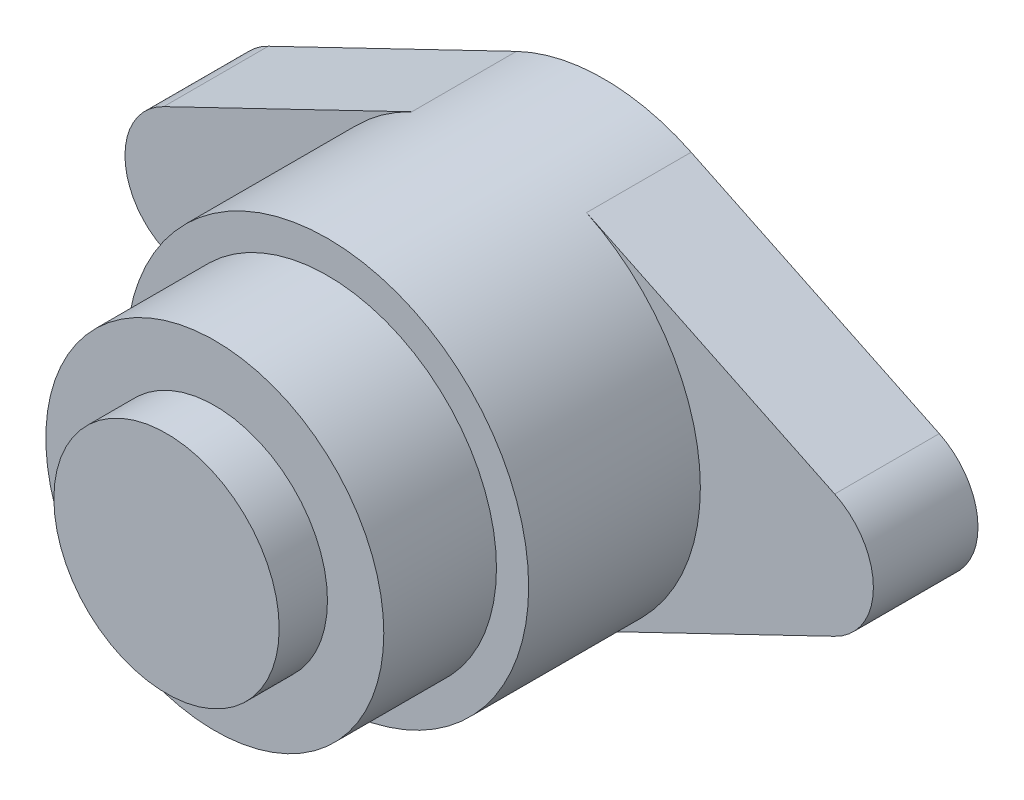
ISO-10303-21;
HEADER;
FILE_DESCRIPTION(('STEP AP214'),'2;1');
FILE_NAME('part.step','',(''),(''),'','','');
FILE_SCHEMA(('AUTOMOTIVE_DESIGN { 1 0 10303 214 1 1 1 1 }'));
ENDSEC;
DATA;
#1=APPLICATION_CONTEXT('core data for automotive mechanical design processes');
#2=APPLICATION_PROTOCOL_DEFINITION('international standard','automotive_design',2000,#1);
#3=PRODUCT_CONTEXT('',#1,'mechanical');
#4=PRODUCT('Part','Part','',(#3));
#5=PRODUCT_RELATED_PRODUCT_CATEGORY('part','',(#4));
#6=PRODUCT_DEFINITION_FORMATION('','',#4);
#7=PRODUCT_DEFINITION_CONTEXT('part definition',#1,'design');
#8=PRODUCT_DEFINITION('design','',#6,#7);
#9=PRODUCT_DEFINITION_SHAPE('','',#8);
#10=(LENGTH_UNIT() NAMED_UNIT(*) SI_UNIT(.MILLI.,.METRE.));
#11=(NAMED_UNIT(*) PLANE_ANGLE_UNIT() SI_UNIT($,.RADIAN.));
#12=(NAMED_UNIT(*) SI_UNIT($,.STERADIAN.) SOLID_ANGLE_UNIT());
#13=UNCERTAINTY_MEASURE_WITH_UNIT(LENGTH_MEASURE(1.E-05),#10,'distance_accuracy_value','');
#14=(GEOMETRIC_REPRESENTATION_CONTEXT(3) GLOBAL_UNCERTAINTY_ASSIGNED_CONTEXT((#13)) GLOBAL_UNIT_ASSIGNED_CONTEXT((#10,
#11,#12)) REPRESENTATION_CONTEXT('',''));
#15=CARTESIAN_POINT('',(0.,0.,0.));
#16=DIRECTION('',(0.,0.,1.));
#17=DIRECTION('',(1.,0.,0.));
#18=AXIS2_PLACEMENT_3D('',#15,#16,#17);
#19=CARTESIAN_POINT('',(-19.,0.,6.5));
#20=DIRECTION('',(0.,0.,1.));
#21=DIRECTION('',(1.,0.,0.));
#22=AXIS2_PLACEMENT_3D('',#19,#20,#21);
#23=PLANE('',#22);
#24=CARTESIAN_POINT('',(0.,0.,6.5));
#25=DIRECTION('',(0.,0.,1.));
#26=DIRECTION('',(1.,0.,0.));
#27=AXIS2_PLACEMENT_3D('',#24,#25,#26);
#28=CIRCLE('',#27,12.5);
#29=CARTESIAN_POINT('',(-5.42763157894741,11.260142780765,6.5));
#30=VERTEX_POINT('',#29);
#31=CARTESIAN_POINT('',(-5.42763157894742,-11.2601427807649,6.5));
#32=VERTEX_POINT('',#31);
#33=EDGE_CURVE('E170',#30,#32,#28,.T.);
#34=ORIENTED_EDGE('',*,*,#33,.F.);
#35=DIRECTION('',(-0.900811422461196,-0.434210526315792,0.));
#36=VECTOR('',#35,1.);
#37=CARTESIAN_POINT('',(-20.8453947368421,3.82844854546008,6.5));
#38=LINE('',#37,#36);
#39=CARTESIAN_POINT('',(-20.8453947368421,3.82844854546008,6.5));
#40=VERTEX_POINT('',#39);
#41=EDGE_CURVE('E54',#30,#40,#38,.T.);
#42=ORIENTED_EDGE('',*,*,#41,.T.);
#43=CARTESIAN_POINT('',(-19.,0.,6.5));
#44=DIRECTION('',(0.,0.,1.));
#45=DIRECTION('',(1.,0.,0.));
#46=AXIS2_PLACEMENT_3D('',#43,#44,#45);
#47=CIRCLE('',#46,4.25);
#48=CARTESIAN_POINT('',(-20.8453947368421,-3.82844854546009,6.5));
#49=VERTEX_POINT('',#48);
#50=EDGE_CURVE('E156',#40,#49,#47,.T.);
#51=ORIENTED_EDGE('',*,*,#50,.T.);
#52=DIRECTION('',(0.900811422461198,-0.434210526315788,0.));
#53=VECTOR('',#52,1.);
#54=CARTESIAN_POINT('',(-20.8453947368421,-3.82844854546009,6.5));
#55=LINE('',#54,#53);
#56=EDGE_CURVE('E99',#49,#32,#55,.T.);
#57=ORIENTED_EDGE('',*,*,#56,.T.);
#58=EDGE_LOOP('',(#34,#42,#51,#57));
#59=FACE_BOUND('',#58,.T.);
#60=ADVANCED_FACE('F35',(#59),#23,.T.);
#61=CARTESIAN_POINT('',(-19.,0.,6.5));
#62=DIRECTION('',(0.,0.,-1.));
#63=DIRECTION('',(-1.,0.,0.));
#64=AXIS2_PLACEMENT_3D('',#61,#62,#63);
#65=CYLINDRICAL_SURFACE('',#64,4.25);
#66=CARTESIAN_POINT('',(-19.,0.,0.));
#67=DIRECTION('',(0.,0.,1.));
#68=DIRECTION('',(1.,0.,0.));
#69=AXIS2_PLACEMENT_3D('',#66,#67,#68);
#70=CIRCLE('',#69,4.25);
#71=CARTESIAN_POINT('',(-20.8453947368421,3.82844854546008,0.));
#72=VERTEX_POINT('',#71);
#73=CARTESIAN_POINT('',(-20.8453947368421,-3.82844854546009,0.));
#74=VERTEX_POINT('',#73);
#75=EDGE_CURVE('E141',#72,#74,#70,.T.);
#76=ORIENTED_EDGE('',*,*,#75,.T.);
#77=DIRECTION('',(0.,0.,-1.));
#78=VECTOR('',#77,1.);
#79=CARTESIAN_POINT('',(-20.8453947368421,-3.82844854546009,6.5));
#80=LINE('',#79,#78);
#81=EDGE_CURVE('E39',#49,#74,#80,.T.);
#82=ORIENTED_EDGE('',*,*,#81,.F.);
#83=ORIENTED_EDGE('',*,*,#50,.F.);
#84=DIRECTION('',(0.,0.,-1.));
#85=VECTOR('',#84,1.);
#86=CARTESIAN_POINT('',(-20.8453947368421,3.82844854546008,6.5));
#87=LINE('',#86,#85);
#88=EDGE_CURVE('E137',#40,#72,#87,.T.);
#89=ORIENTED_EDGE('',*,*,#88,.T.);
#90=EDGE_LOOP('',(#76,#82,#83,#89));
#91=FACE_BOUND('',#90,.T.);
#92=ADVANCED_FACE('F37',(#91),#65,.T.);
#93=CARTESIAN_POINT('',(-20.8453947368421,-3.82844854546009,6.5));
#94=DIRECTION('',(0.434210526315788,0.900811422461198,0.));
#95=DIRECTION('',(-0.900811422461198,0.434210526315788,0.));
#96=AXIS2_PLACEMENT_3D('',#93,#94,#95);
#97=PLANE('',#96);
#98=DIRECTION('',(0.900811422461198,-0.434210526315788,0.));
#99=VECTOR('',#98,1.);
#100=CARTESIAN_POINT('',(-20.8453947368421,-3.82844854546009,0.));
#101=LINE('',#100,#99);
#102=CARTESIAN_POINT('',(-5.42763157894742,-11.2601427807649,0.));
#103=VERTEX_POINT('',#102);
#104=EDGE_CURVE('E144',#74,#103,#101,.T.);
#105=ORIENTED_EDGE('',*,*,#104,.T.);
#106=DIRECTION('',(0.,0.,-1.));
#107=VECTOR('',#106,1.);
#108=CARTESIAN_POINT('',(-5.42763157894742,-11.2601427807649,6.5));
#109=LINE('',#108,#107);
#110=EDGE_CURVE('E164',#32,#103,#109,.T.);
#111=ORIENTED_EDGE('',*,*,#110,.F.);
#112=ORIENTED_EDGE('',*,*,#56,.F.);
#113=ORIENTED_EDGE('',*,*,#81,.T.);
#114=EDGE_LOOP('',(#105,#111,#112,#113));
#115=FACE_BOUND('',#114,.T.);
#116=ADVANCED_FACE('F178',(#115),#97,.F.);
#117=CARTESIAN_POINT('',(5.42763157894741,-11.2601427807649,6.5));
#118=DIRECTION('',(-0.434210526315788,0.900811422461198,0.));
#119=DIRECTION('',(-0.900811422461198,-0.434210526315788,0.));
#120=AXIS2_PLACEMENT_3D('',#117,#118,#119);
#121=PLANE('',#120);
#122=DIRECTION('',(0.900811422461198,0.434210526315788,0.));
#123=VECTOR('',#122,1.);
#124=CARTESIAN_POINT('',(5.42763157894741,-11.2601427807649,0.));
#125=LINE('',#124,#123);
#126=CARTESIAN_POINT('',(5.42763157894741,-11.2601427807649,0.));
#127=VERTEX_POINT('',#126);
#128=CARTESIAN_POINT('',(20.8453947368421,-3.82844854546009,0.));
#129=VERTEX_POINT('',#128);
#130=EDGE_CURVE('E149',#127,#129,#125,.T.);
#131=ORIENTED_EDGE('',*,*,#130,.T.);
#132=DIRECTION('',(0.,0.,-1.));
#133=VECTOR('',#132,1.);
#134=CARTESIAN_POINT('',(20.8453947368421,-3.82844854546009,6.5));
#135=LINE('',#134,#133);
#136=CARTESIAN_POINT('',(20.8453947368421,-3.82844854546009,6.5));
#137=VERTEX_POINT('',#136);
#138=EDGE_CURVE('E131',#137,#129,#135,.T.);
#139=ORIENTED_EDGE('',*,*,#138,.F.);
#140=DIRECTION('',(0.900811422461198,0.434210526315788,0.));
#141=VECTOR('',#140,1.);
#142=CARTESIAN_POINT('',(5.42763157894741,-11.2601427807649,6.5));
#143=LINE('',#142,#141);
#144=CARTESIAN_POINT('',(5.42763157894741,-11.2601427807649,6.5));
#145=VERTEX_POINT('',#144);
#146=EDGE_CURVE('E119',#145,#137,#143,.T.);
#147=ORIENTED_EDGE('',*,*,#146,.F.);
#148=DIRECTION('',(0.,0.,-1.));
#149=VECTOR('',#148,1.);
#150=CARTESIAN_POINT('',(5.42763157894741,-11.2601427807649,6.5));
#151=LINE('',#150,#149);
#152=EDGE_CURVE('E162',#145,#127,#151,.T.);
#153=ORIENTED_EDGE('',*,*,#152,.T.);
#154=EDGE_LOOP('',(#131,#139,#147,#153));
#155=FACE_BOUND('',#154,.T.);
#156=ADVANCED_FACE('F188',(#155),#121,.F.);
#157=CARTESIAN_POINT('',(19.,0.,6.5));
#158=DIRECTION('',(0.,0.,-1.));
#159=DIRECTION('',(-1.,0.,0.));
#160=AXIS2_PLACEMENT_3D('',#157,#158,#159);
#161=CYLINDRICAL_SURFACE('',#160,4.24999999999999);
#162=CARTESIAN_POINT('',(19.,0.,0.));
#163=DIRECTION('',(0.,0.,1.));
#164=DIRECTION('',(1.,0.,0.));
#165=AXIS2_PLACEMENT_3D('',#162,#163,#164);
#166=CIRCLE('',#165,4.24999999999999);
#167=CARTESIAN_POINT('',(20.8453947368421,3.82844854546008,0.));
#168=VERTEX_POINT('',#167);
#169=EDGE_CURVE('E128',#129,#168,#166,.T.);
#170=ORIENTED_EDGE('',*,*,#169,.T.);
#171=DIRECTION('',(0.,0.,-1.));
#172=VECTOR('',#171,1.);
#173=CARTESIAN_POINT('',(20.8453947368421,3.82844854546008,6.5));
#174=LINE('',#173,#172);
#175=CARTESIAN_POINT('',(20.8453947368421,3.82844854546008,6.5));
#176=VERTEX_POINT('',#175);
#177=EDGE_CURVE('E125',#176,#168,#174,.T.);
#178=ORIENTED_EDGE('',*,*,#177,.F.);
#179=CARTESIAN_POINT('',(19.,0.,6.5));
#180=DIRECTION('',(0.,0.,1.));
#181=DIRECTION('',(1.,0.,0.));
#182=AXIS2_PLACEMENT_3D('',#179,#180,#181);
#183=CIRCLE('',#182,4.24999999999999);
#184=EDGE_CURVE('E112',#137,#176,#183,.T.);
#185=ORIENTED_EDGE('',*,*,#184,.F.);
#186=ORIENTED_EDGE('',*,*,#138,.T.);
#187=EDGE_LOOP('',(#170,#178,#185,#186));
#188=FACE_BOUND('',#187,.T.);
#189=ADVANCED_FACE('F126',(#188),#161,.T.);
#190=CARTESIAN_POINT('',(5.42763157894741,11.260142780765,6.5));
#191=DIRECTION('',(-0.434210526315792,-0.900811422461196,0.));
#192=DIRECTION('',(0.900811422461196,-0.434210526315792,0.));
#193=AXIS2_PLACEMENT_3D('',#190,#191,#192);
#194=PLANE('',#193);
#195=DIRECTION('',(-0.900811422461196,0.434210526315792,0.));
#196=VECTOR('',#195,1.);
#197=CARTESIAN_POINT('',(5.42763157894741,11.260142780765,0.));
#198=LINE('',#197,#196);
#199=CARTESIAN_POINT('',(5.42763157894741,11.260142780765,0.));
#200=VERTEX_POINT('',#199);
#201=EDGE_CURVE('E152',#168,#200,#198,.T.);
#202=ORIENTED_EDGE('',*,*,#201,.T.);
#203=DIRECTION('',(0.,0.,-1.));
#204=VECTOR('',#203,1.);
#205=CARTESIAN_POINT('',(5.42763157894741,11.260142780765,6.5));
#206=LINE('',#205,#204);
#207=CARTESIAN_POINT('',(5.4276315789474,11.2601427807649,6.5));
#208=VERTEX_POINT('',#207);
#209=EDGE_CURVE('E132',#208,#200,#206,.T.);
#210=ORIENTED_EDGE('',*,*,#209,.F.);
#211=DIRECTION('',(-0.900811422461196,0.434210526315792,0.));
#212=VECTOR('',#211,1.);
#213=CARTESIAN_POINT('',(5.42763157894741,11.260142780765,6.5));
#214=LINE('',#213,#212);
#215=EDGE_CURVE('E116',#176,#208,#214,.T.);
#216=ORIENTED_EDGE('',*,*,#215,.F.);
#217=ORIENTED_EDGE('',*,*,#177,.T.);
#218=EDGE_LOOP('',(#202,#210,#216,#217));
#219=FACE_BOUND('',#218,.T.);
#220=ADVANCED_FACE('F135',(#219),#194,.F.);
#221=CARTESIAN_POINT('',(0.,0.,6.5));
#222=DIRECTION('',(0.,0.,-1.));
#223=DIRECTION('',(-1.,0.,0.));
#224=AXIS2_PLACEMENT_3D('',#221,#222,#223);
#225=CYLINDRICAL_SURFACE('',#224,12.5);
#226=CARTESIAN_POINT('',(0.,0.,0.));
#227=DIRECTION('',(0.,0.,1.));
#228=DIRECTION('',(-1.,0.,0.));
#229=AXIS2_PLACEMENT_3D('',#226,#227,#228);
#230=CIRCLE('',#229,12.5);
#231=CARTESIAN_POINT('',(-5.42763157894741,11.260142780765,0.));
#232=VERTEX_POINT('',#231);
#233=EDGE_CURVE('E84',#200,#232,#230,.T.);
#234=ORIENTED_EDGE('',*,*,#233,.T.);
#235=DIRECTION('',(0.,0.,-1.));
#236=VECTOR('',#235,1.);
#237=CARTESIAN_POINT('',(-5.42763157894741,11.260142780765,6.5));
#238=LINE('',#237,#236);
#239=EDGE_CURVE('E158',#30,#232,#238,.T.);
#240=ORIENTED_EDGE('',*,*,#239,.F.);
#241=ORIENTED_EDGE('',*,*,#33,.T.);
#242=ORIENTED_EDGE('',*,*,#110,.T.);
#243=CARTESIAN_POINT('',(0.,0.,0.));
#244=DIRECTION('',(0.,0.,1.));
#245=DIRECTION('',(1.,0.,0.));
#246=AXIS2_PLACEMENT_3D('',#243,#244,#245);
#247=CIRCLE('',#246,12.5);
#248=EDGE_CURVE('E147',#103,#127,#247,.T.);
#249=ORIENTED_EDGE('',*,*,#248,.T.);
#250=ORIENTED_EDGE('',*,*,#152,.F.);
#251=EDGE_CURVE('E168',#145,#208,#28,.T.);
#252=ORIENTED_EDGE('',*,*,#251,.T.);
#253=ORIENTED_EDGE('',*,*,#209,.T.);
#254=EDGE_LOOP('',(#234,#240,#241,#242,#249,#250,#252,#253));
#255=FACE_BOUND('',#254,.T.);
#256=CARTESIAN_POINT('',(0.,0.,17.168));
#257=DIRECTION('',(0.,0.,1.));
#258=DIRECTION('',(1.,0.,0.));
#259=AXIS2_PLACEMENT_3D('',#256,#257,#258);
#260=CIRCLE('',#259,12.5);
#261=CARTESIAN_POINT('',(12.5,0.,17.168));
#262=VERTEX_POINT('',#261);
#263=EDGE_CURVE('E145',#262,#262,#260,.T.);
#264=ORIENTED_EDGE('',*,*,#263,.F.);
#265=EDGE_LOOP('',(#264));
#266=FACE_BOUND('',#265,.T.);
#267=ADVANCED_FACE('F179',(#255,#266),#225,.T.);
#268=CARTESIAN_POINT('',(-20.8453947368421,3.82844854546008,6.5));
#269=DIRECTION('',(0.434210526315792,-0.900811422461196,0.));
#270=DIRECTION('',(0.900811422461196,0.434210526315792,0.));
#271=AXIS2_PLACEMENT_3D('',#268,#269,#270);
#272=PLANE('',#271);
#273=DIRECTION('',(-0.900811422461196,-0.434210526315792,0.));
#274=VECTOR('',#273,1.);
#275=CARTESIAN_POINT('',(-20.8453947368421,3.82844854546008,0.));
#276=LINE('',#275,#274);
#277=EDGE_CURVE('E90',#232,#72,#276,.T.);
#278=ORIENTED_EDGE('',*,*,#277,.T.);
#279=ORIENTED_EDGE('',*,*,#88,.F.);
#280=ORIENTED_EDGE('',*,*,#41,.F.);
#281=ORIENTED_EDGE('',*,*,#239,.T.);
#282=EDGE_LOOP('',(#278,#279,#280,#281));
#283=FACE_BOUND('',#282,.T.);
#284=ADVANCED_FACE('F181',(#283),#272,.F.);
#285=ORIENTED_EDGE('',*,*,#251,.F.);
#286=ORIENTED_EDGE('',*,*,#146,.T.);
#287=ORIENTED_EDGE('',*,*,#184,.T.);
#288=ORIENTED_EDGE('',*,*,#215,.T.);
#289=EDGE_LOOP('',(#285,#286,#287,#288));
#290=FACE_BOUND('',#289,.T.);
#291=ADVANCED_FACE('F114',(#290),#23,.T.);
#292=CARTESIAN_POINT('',(-19.,0.,0.));
#293=DIRECTION('',(0.,0.,1.));
#294=DIRECTION('',(1.,0.,0.));
#295=AXIS2_PLACEMENT_3D('',#292,#293,#294);
#296=PLANE('',#295);
#297=ORIENTED_EDGE('',*,*,#75,.F.);
#298=ORIENTED_EDGE('',*,*,#277,.F.);
#299=ORIENTED_EDGE('',*,*,#233,.F.);
#300=ORIENTED_EDGE('',*,*,#201,.F.);
#301=ORIENTED_EDGE('',*,*,#169,.F.);
#302=ORIENTED_EDGE('',*,*,#130,.F.);
#303=ORIENTED_EDGE('',*,*,#248,.F.);
#304=ORIENTED_EDGE('',*,*,#104,.F.);
#305=EDGE_LOOP('',(#297,#298,#299,#300,#301,#302,#303,#304));
#306=FACE_BOUND('',#305,.T.);
#307=ADVANCED_FACE('F185',(#306),#296,.F.);
#308=CARTESIAN_POINT('',(0.,0.,17.168));
#309=DIRECTION('',(0.,0.,1.));
#310=DIRECTION('',(1.,0.,0.));
#311=AXIS2_PLACEMENT_3D('',#308,#309,#310);
#312=PLANE('',#311);
#313=CARTESIAN_POINT('',(0.,0.,17.168));
#314=DIRECTION('',(0.,0.,1.));
#315=DIRECTION('',(1.,0.,0.));
#316=AXIS2_PLACEMENT_3D('',#313,#314,#315);
#317=CIRCLE('',#316,10.5);
#318=CARTESIAN_POINT('',(10.5,0.,17.168));
#319=VERTEX_POINT('',#318);
#320=EDGE_CURVE('E45',#319,#319,#317,.T.);
#321=ORIENTED_EDGE('',*,*,#320,.F.);
#322=EDGE_LOOP('',(#321));
#323=FACE_BOUND('',#322,.T.);
#324=ORIENTED_EDGE('',*,*,#263,.T.);
#325=EDGE_LOOP('',(#324));
#326=FACE_BOUND('',#325,.T.);
#327=ADVANCED_FACE('F208',(#323,#326),#312,.T.);
#328=CARTESIAN_POINT('',(0.,0.,24.168));
#329=DIRECTION('',(0.,0.,-1.));
#330=DIRECTION('',(-1.,0.,0.));
#331=AXIS2_PLACEMENT_3D('',#328,#329,#330);
#332=CYLINDRICAL_SURFACE('',#331,10.5);
#333=CARTESIAN_POINT('',(0.,0.,24.168));
#334=DIRECTION('',(0.,0.,1.));
#335=DIRECTION('',(1.,0.,0.));
#336=AXIS2_PLACEMENT_3D('',#333,#334,#335);
#337=CIRCLE('',#336,10.5);
#338=CARTESIAN_POINT('',(10.5,0.,24.168));
#339=VERTEX_POINT('',#338);
#340=EDGE_CURVE('E295',#339,#339,#337,.T.);
#341=ORIENTED_EDGE('',*,*,#340,.F.);
#342=EDGE_LOOP('',(#341));
#343=FACE_BOUND('',#342,.T.);
#344=ORIENTED_EDGE('',*,*,#320,.T.);
#345=EDGE_LOOP('',(#344));
#346=FACE_BOUND('',#345,.T.);
#347=ADVANCED_FACE('F249',(#343,#346),#332,.T.);
#348=CARTESIAN_POINT('',(0.,0.,24.168));
#349=DIRECTION('',(0.,0.,1.));
#350=DIRECTION('',(1.,0.,0.));
#351=AXIS2_PLACEMENT_3D('',#348,#349,#350);
#352=PLANE('',#351);
#353=CARTESIAN_POINT('',(0.,0.,24.168));
#354=DIRECTION('',(0.,0.,1.));
#355=DIRECTION('',(1.,0.,0.));
#356=AXIS2_PLACEMENT_3D('',#353,#354,#355);
#357=CIRCLE('',#356,7.);
#358=CARTESIAN_POINT('',(7.,0.,24.168));
#359=VERTEX_POINT('',#358);
#360=EDGE_CURVE('E11',#359,#359,#357,.T.);
#361=ORIENTED_EDGE('',*,*,#360,.F.);
#362=EDGE_LOOP('',(#361));
#363=FACE_BOUND('',#362,.T.);
#364=ORIENTED_EDGE('',*,*,#340,.T.);
#365=EDGE_LOOP('',(#364));
#366=FACE_BOUND('',#365,.T.);
#367=ADVANCED_FACE('F258',(#363,#366),#352,.T.);
#368=CARTESIAN_POINT('',(0.,0.,27.168));
#369=DIRECTION('',(0.,0.,-1.));
#370=DIRECTION('',(-1.,0.,0.));
#371=AXIS2_PLACEMENT_3D('',#368,#369,#370);
#372=CYLINDRICAL_SURFACE('',#371,7.);
#373=CARTESIAN_POINT('',(0.,0.,27.168));
#374=DIRECTION('',(0.,0.,1.));
#375=DIRECTION('',(1.,0.,0.));
#376=AXIS2_PLACEMENT_3D('',#373,#374,#375);
#377=CIRCLE('',#376,7.);
#378=CARTESIAN_POINT('',(7.,0.,27.168));
#379=VERTEX_POINT('',#378);
#380=EDGE_CURVE('E294',#379,#379,#377,.T.);
#381=ORIENTED_EDGE('',*,*,#380,.F.);
#382=EDGE_LOOP('',(#381));
#383=FACE_BOUND('',#382,.T.);
#384=ORIENTED_EDGE('',*,*,#360,.T.);
#385=EDGE_LOOP('',(#384));
#386=FACE_BOUND('',#385,.T.);
#387=ADVANCED_FACE('F268',(#383,#386),#372,.T.);
#388=CARTESIAN_POINT('',(0.,0.,27.168));
#389=DIRECTION('',(0.,0.,1.));
#390=DIRECTION('',(1.,0.,0.));
#391=AXIS2_PLACEMENT_3D('',#388,#389,#390);
#392=PLANE('',#391);
#393=ORIENTED_EDGE('',*,*,#380,.T.);
#394=EDGE_LOOP('',(#393));
#395=FACE_BOUND('',#394,.T.);
#396=ADVANCED_FACE('F278',(#395),#392,.T.);
#397=CLOSED_SHELL('',(#60,#92,#116,#156,#189,#220,#267,#284,#291,#307,#327,#347,#367,#387,#396));
#398=MANIFOLD_SOLID_BREP('B2',#397);
#399=ADVANCED_BREP_SHAPE_REPRESENTATION('',(#18,#398),#14);
#400=SHAPE_DEFINITION_REPRESENTATION(#9,#399);
ENDSEC;
END-ISO-10303-21;
